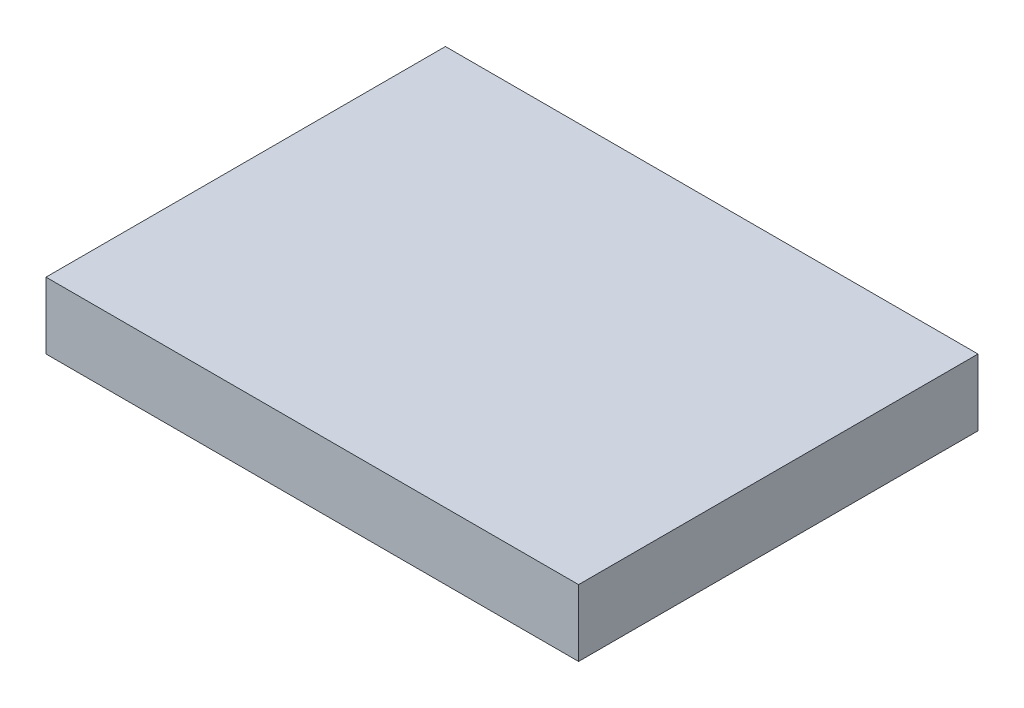
ISO-10303-21;
HEADER;
FILE_DESCRIPTION(('STEP AP214'),'2;1');
FILE_NAME('part.step','',(''),(''),'','','');
FILE_SCHEMA(('AUTOMOTIVE_DESIGN { 1 0 10303 214 1 1 1 1 }'));
ENDSEC;
DATA;
#1=APPLICATION_CONTEXT('core data for automotive mechanical design processes');
#2=APPLICATION_PROTOCOL_DEFINITION('international standard','automotive_design',2000,#1);
#3=PRODUCT_CONTEXT('',#1,'mechanical');
#4=PRODUCT('Part','Part','',(#3));
#5=PRODUCT_RELATED_PRODUCT_CATEGORY('part','',(#4));
#6=PRODUCT_DEFINITION_FORMATION('','',#4);
#7=PRODUCT_DEFINITION_CONTEXT('part definition',#1,'design');
#8=PRODUCT_DEFINITION('design','',#6,#7);
#9=PRODUCT_DEFINITION_SHAPE('','',#8);
#10=(LENGTH_UNIT() NAMED_UNIT(*) SI_UNIT(.MILLI.,.METRE.));
#11=(NAMED_UNIT(*) PLANE_ANGLE_UNIT() SI_UNIT($,.RADIAN.));
#12=(NAMED_UNIT(*) SI_UNIT($,.STERADIAN.) SOLID_ANGLE_UNIT());
#13=UNCERTAINTY_MEASURE_WITH_UNIT(LENGTH_MEASURE(1.E-05),#10,'distance_accuracy_value','');
#14=(GEOMETRIC_REPRESENTATION_CONTEXT(3) GLOBAL_UNCERTAINTY_ASSIGNED_CONTEXT((#13)) GLOBAL_UNIT_ASSIGNED_CONTEXT((#10,
#11,#12)) REPRESENTATION_CONTEXT('',''));
#15=CARTESIAN_POINT('',(0.,0.,0.));
#16=DIRECTION('',(0.,0.,1.));
#17=DIRECTION('',(1.,0.,0.));
#18=AXIS2_PLACEMENT_3D('',#15,#16,#17);
#19=CARTESIAN_POINT('',(25.6,1.52,15.46));
#20=DIRECTION('',(0.,-1.,0.));
#21=DIRECTION('',(0.,0.,-1.));
#22=AXIS2_PLACEMENT_3D('',#19,#20,#21);
#23=PLANE('',#22);
#24=DIRECTION('',(0.,0.,-1.));
#25=VECTOR('',#24,1.);
#26=CARTESIAN_POINT('',(26.4,1.52,15.16));
#27=LINE('',#26,#25);
#28=CARTESIAN_POINT('',(26.4,1.52,15.46));
#29=VERTEX_POINT('',#28);
#30=CARTESIAN_POINT('',(26.4,1.52,14.86));
#31=VERTEX_POINT('',#30);
#32=EDGE_CURVE('E68',#29,#31,#27,.T.);
#33=ORIENTED_EDGE('',*,*,#32,.F.);
#34=DIRECTION('',(1.,0.,0.));
#35=VECTOR('',#34,1.);
#36=CARTESIAN_POINT('',(25.6,1.52,15.46));
#37=LINE('',#36,#35);
#38=CARTESIAN_POINT('',(25.6,1.52,15.46));
#39=VERTEX_POINT('',#38);
#40=EDGE_CURVE('E55',#39,#29,#37,.T.);
#41=ORIENTED_EDGE('',*,*,#40,.F.);
#42=DIRECTION('',(0.,0.,-1.));
#43=VECTOR('',#42,1.);
#44=CARTESIAN_POINT('',(25.6,1.52,15.16));
#45=LINE('',#44,#43);
#46=CARTESIAN_POINT('',(25.6,1.52,14.86));
#47=VERTEX_POINT('',#46);
#48=EDGE_CURVE('E20',#39,#47,#45,.T.);
#49=ORIENTED_EDGE('',*,*,#48,.T.);
#50=DIRECTION('',(-1.,0.,0.));
#51=VECTOR('',#50,1.);
#52=CARTESIAN_POINT('',(25.6,1.52,14.86));
#53=LINE('',#52,#51);
#54=EDGE_CURVE('E81',#31,#47,#53,.T.);
#55=ORIENTED_EDGE('',*,*,#54,.F.);
#56=EDGE_LOOP('',(#33,#41,#49,#55));
#57=FACE_BOUND('',#56,.T.);
#58=ADVANCED_FACE('F17',(#57),#23,.T.);
#59=CARTESIAN_POINT('',(25.6,1.57,15.16));
#60=DIRECTION('',(1.,0.,0.));
#61=DIRECTION('',(0.,0.,-1.));
#62=AXIS2_PLACEMENT_3D('',#59,#60,#61);
#63=PLANE('',#62);
#64=DIRECTION('',(0.,0.,1.));
#65=VECTOR('',#64,1.);
#66=CARTESIAN_POINT('',(25.6,1.62,14.86));
#67=LINE('',#66,#65);
#68=CARTESIAN_POINT('',(25.6,1.62,14.86));
#69=VERTEX_POINT('',#68);
#70=CARTESIAN_POINT('',(25.6,1.62,15.46));
#71=VERTEX_POINT('',#70);
#72=EDGE_CURVE('E83',#69,#71,#67,.T.);
#73=ORIENTED_EDGE('',*,*,#72,.F.);
#74=DIRECTION('',(0.,1.,0.));
#75=VECTOR('',#74,1.);
#76=CARTESIAN_POINT('',(25.6,1.52,14.86));
#77=LINE('',#76,#75);
#78=EDGE_CURVE('E64',#47,#69,#77,.T.);
#79=ORIENTED_EDGE('',*,*,#78,.F.);
#80=ORIENTED_EDGE('',*,*,#48,.F.);
#81=DIRECTION('',(0.,1.,0.));
#82=VECTOR('',#81,1.);
#83=CARTESIAN_POINT('',(25.6,1.62,15.46));
#84=LINE('',#83,#82);
#85=EDGE_CURVE('E61',#71,#39,#84,.F.);
#86=ORIENTED_EDGE('',*,*,#85,.F.);
#87=EDGE_LOOP('',(#73,#79,#80,#86));
#88=FACE_BOUND('',#87,.T.);
#89=ADVANCED_FACE('F60',(#88),#63,.F.);
#90=CARTESIAN_POINT('',(25.6,1.62,15.46));
#91=DIRECTION('',(0.,0.,1.));
#92=DIRECTION('',(1.,0.,0.));
#93=AXIS2_PLACEMENT_3D('',#90,#91,#92);
#94=PLANE('',#93);
#95=DIRECTION('',(0.,1.,0.));
#96=VECTOR('',#95,1.);
#97=CARTESIAN_POINT('',(26.4,1.57,15.46));
#98=LINE('',#97,#96);
#99=CARTESIAN_POINT('',(26.4,1.62,15.46));
#100=VERTEX_POINT('',#99);
#101=EDGE_CURVE('E70',#100,#29,#98,.F.);
#102=ORIENTED_EDGE('',*,*,#101,.F.);
#103=DIRECTION('',(1.,0.,0.));
#104=VECTOR('',#103,1.);
#105=CARTESIAN_POINT('',(25.6,1.62,15.46));
#106=LINE('',#105,#104);
#107=EDGE_CURVE('E74',#71,#100,#106,.T.);
#108=ORIENTED_EDGE('',*,*,#107,.F.);
#109=ORIENTED_EDGE('',*,*,#85,.T.);
#110=ORIENTED_EDGE('',*,*,#40,.T.);
#111=EDGE_LOOP('',(#102,#108,#109,#110));
#112=FACE_BOUND('',#111,.T.);
#113=ADVANCED_FACE('F72',(#112),#94,.T.);
#114=CARTESIAN_POINT('',(26.4,1.57,15.16));
#115=DIRECTION('',(1.,0.,0.));
#116=DIRECTION('',(0.,0.,-1.));
#117=AXIS2_PLACEMENT_3D('',#114,#115,#116);
#118=PLANE('',#117);
#119=DIRECTION('',(0.,1.,0.));
#120=VECTOR('',#119,1.);
#121=CARTESIAN_POINT('',(26.4,1.52,14.86));
#122=LINE('',#121,#120);
#123=CARTESIAN_POINT('',(26.4,1.62,14.86));
#124=VERTEX_POINT('',#123);
#125=EDGE_CURVE('E35',#124,#31,#122,.F.);
#126=ORIENTED_EDGE('',*,*,#125,.F.);
#127=DIRECTION('',(0.,0.,1.));
#128=VECTOR('',#127,1.);
#129=CARTESIAN_POINT('',(26.4,1.62,14.86));
#130=LINE('',#129,#128);
#131=EDGE_CURVE('E26',#100,#124,#130,.F.);
#132=ORIENTED_EDGE('',*,*,#131,.F.);
#133=ORIENTED_EDGE('',*,*,#101,.T.);
#134=ORIENTED_EDGE('',*,*,#32,.T.);
#135=EDGE_LOOP('',(#126,#132,#133,#134));
#136=FACE_BOUND('',#135,.T.);
#137=ADVANCED_FACE('F89',(#136),#118,.T.);
#138=CARTESIAN_POINT('',(25.6,1.52,14.86));
#139=DIRECTION('',(0.,0.,-1.));
#140=DIRECTION('',(-1.,0.,0.));
#141=AXIS2_PLACEMENT_3D('',#138,#139,#140);
#142=PLANE('',#141);
#143=ORIENTED_EDGE('',*,*,#125,.T.);
#144=ORIENTED_EDGE('',*,*,#54,.T.);
#145=ORIENTED_EDGE('',*,*,#78,.T.);
#146=DIRECTION('',(1.,0.,0.));
#147=VECTOR('',#146,1.);
#148=CARTESIAN_POINT('',(25.6,1.62,14.86));
#149=LINE('',#148,#147);
#150=EDGE_CURVE('E11',#124,#69,#149,.F.);
#151=ORIENTED_EDGE('',*,*,#150,.F.);
#152=EDGE_LOOP('',(#143,#144,#145,#151));
#153=FACE_BOUND('',#152,.T.);
#154=ADVANCED_FACE('F91',(#153),#142,.T.);
#155=CARTESIAN_POINT('',(25.6,1.62,14.86));
#156=DIRECTION('',(0.,1.,0.));
#157=DIRECTION('',(0.,0.,1.));
#158=AXIS2_PLACEMENT_3D('',#155,#156,#157);
#159=PLANE('',#158);
#160=ORIENTED_EDGE('',*,*,#131,.T.);
#161=ORIENTED_EDGE('',*,*,#150,.T.);
#162=ORIENTED_EDGE('',*,*,#72,.T.);
#163=ORIENTED_EDGE('',*,*,#107,.T.);
#164=EDGE_LOOP('',(#160,#161,#162,#163));
#165=FACE_BOUND('',#164,.T.);
#166=ADVANCED_FACE('F88',(#165),#159,.T.);
#167=CLOSED_SHELL('',(#58,#89,#113,#137,#154,#166));
#168=MANIFOLD_SOLID_BREP('B1',#167);
#169=ADVANCED_BREP_SHAPE_REPRESENTATION('',(#18,#168),#14);
#170=SHAPE_DEFINITION_REPRESENTATION(#9,#169);
ENDSEC;
END-ISO-10303-21;
